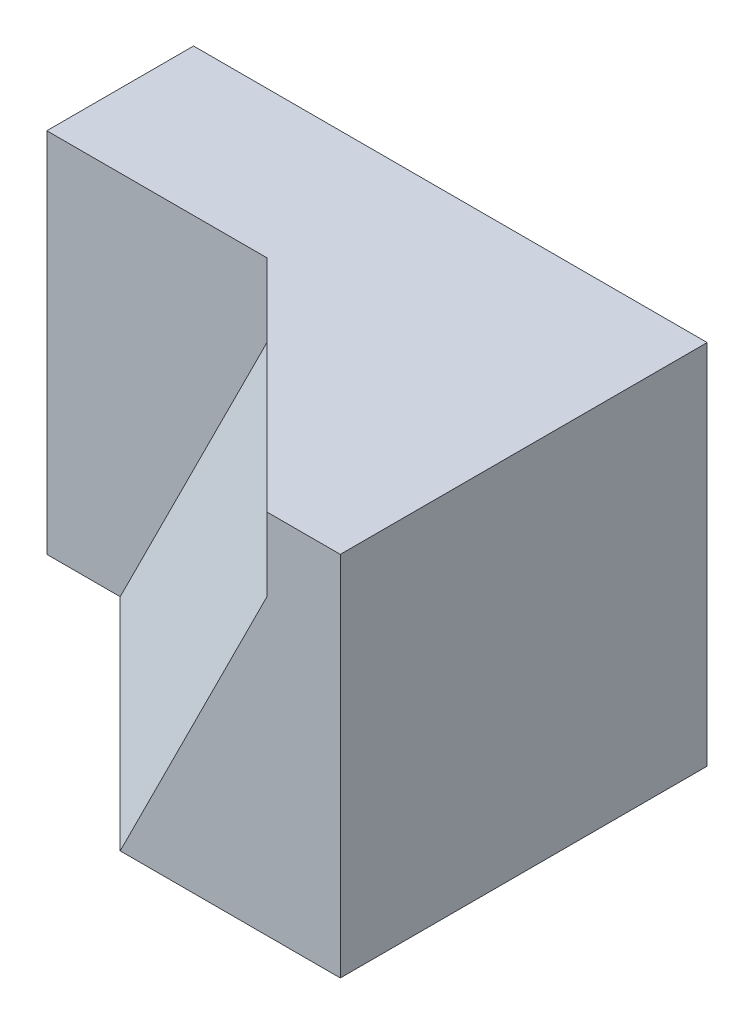
ISO-10303-21;
HEADER;
FILE_DESCRIPTION(('STEP AP214'),'2;1');
FILE_NAME('part.step','',(''),(''),'','','');
FILE_SCHEMA(('AUTOMOTIVE_DESIGN { 1 0 10303 214 1 1 1 1 }'));
ENDSEC;
DATA;
#1=APPLICATION_CONTEXT('core data for automotive mechanical design processes');
#2=APPLICATION_PROTOCOL_DEFINITION('international standard','automotive_design',2000,#1);
#3=PRODUCT_CONTEXT('',#1,'mechanical');
#4=PRODUCT('Part','Part','',(#3));
#5=PRODUCT_RELATED_PRODUCT_CATEGORY('part','',(#4));
#6=PRODUCT_DEFINITION_FORMATION('','',#4);
#7=PRODUCT_DEFINITION_CONTEXT('part definition',#1,'design');
#8=PRODUCT_DEFINITION('design','',#6,#7);
#9=PRODUCT_DEFINITION_SHAPE('','',#8);
#10=(LENGTH_UNIT() NAMED_UNIT(*) SI_UNIT(.MILLI.,.METRE.));
#11=(NAMED_UNIT(*) PLANE_ANGLE_UNIT() SI_UNIT($,.RADIAN.));
#12=(NAMED_UNIT(*) SI_UNIT($,.STERADIAN.) SOLID_ANGLE_UNIT());
#13=UNCERTAINTY_MEASURE_WITH_UNIT(LENGTH_MEASURE(1.E-05),#10,'distance_accuracy_value','');
#14=(GEOMETRIC_REPRESENTATION_CONTEXT(3) GLOBAL_UNCERTAINTY_ASSIGNED_CONTEXT((#13)) GLOBAL_UNIT_ASSIGNED_CONTEXT((#10,
#11,#12)) REPRESENTATION_CONTEXT('',''));
#15=CARTESIAN_POINT('',(0.,0.,0.));
#16=DIRECTION('',(0.,0.,1.));
#17=DIRECTION('',(1.,0.,0.));
#18=AXIS2_PLACEMENT_3D('',#15,#16,#17);
#19=CARTESIAN_POINT('',(0.,0.,50.));
#20=DIRECTION('',(0.,1.,0.));
#21=DIRECTION('',(0.,0.,1.));
#22=AXIS2_PLACEMENT_3D('',#19,#20,#21);
#23=PLANE('',#22);
#24=DIRECTION('',(1.,0.,0.));
#25=VECTOR('',#24,1.);
#26=CARTESIAN_POINT('',(0.,0.,50.));
#27=LINE('',#26,#25);
#28=CARTESIAN_POINT('',(40.,0.,50.));
#29=VERTEX_POINT('',#28);
#30=CARTESIAN_POINT('',(70.,0.,50.));
#31=VERTEX_POINT('',#30);
#32=EDGE_CURVE('E96',#29,#31,#27,.T.);
#33=ORIENTED_EDGE('',*,*,#32,.F.);
#34=DIRECTION('',(-0.707106781186548,0.,-0.707106781186547));
#35=VECTOR('',#34,1.);
#36=CARTESIAN_POINT('',(10.,0.,20.));
#37=LINE('',#36,#35);
#38=CARTESIAN_POINT('',(10.,0.,20.));
#39=VERTEX_POINT('',#38);
#40=EDGE_CURVE('E134',#29,#39,#37,.T.);
#41=ORIENTED_EDGE('',*,*,#40,.T.);
#42=DIRECTION('',(-1.,0.,0.));
#43=VECTOR('',#42,1.);
#44=CARTESIAN_POINT('',(0.,0.,20.));
#45=LINE('',#44,#43);
#46=CARTESIAN_POINT('',(0.,0.,20.));
#47=VERTEX_POINT('',#46);
#48=EDGE_CURVE('E104',#39,#47,#45,.T.);
#49=ORIENTED_EDGE('',*,*,#48,.T.);
#50=DIRECTION('',(0.,0.,-1.));
#51=VECTOR('',#50,1.);
#52=CARTESIAN_POINT('',(0.,0.,50.));
#53=LINE('',#52,#51);
#54=CARTESIAN_POINT('',(0.,0.,0.));
#55=VERTEX_POINT('',#54);
#56=EDGE_CURVE('E11',#47,#55,#53,.T.);
#57=ORIENTED_EDGE('',*,*,#56,.T.);
#58=DIRECTION('',(1.,0.,0.));
#59=VECTOR('',#58,1.);
#60=CARTESIAN_POINT('',(0.,0.,0.));
#61=LINE('',#60,#59);
#62=CARTESIAN_POINT('',(70.,0.,0.));
#63=VERTEX_POINT('',#62);
#64=EDGE_CURVE('E101',#55,#63,#61,.T.);
#65=ORIENTED_EDGE('',*,*,#64,.T.);
#66=DIRECTION('',(0.,0.,-1.));
#67=VECTOR('',#66,1.);
#68=CARTESIAN_POINT('',(70.,0.,50.));
#69=LINE('',#68,#67);
#70=EDGE_CURVE('E41',#31,#63,#69,.T.);
#71=ORIENTED_EDGE('',*,*,#70,.F.);
#72=EDGE_LOOP('',(#33,#41,#49,#57,#65,#71));
#73=FACE_BOUND('',#72,.T.);
#74=ADVANCED_FACE('F33',(#73),#23,.F.);
#75=CARTESIAN_POINT('',(30.,10.,20.));
#76=DIRECTION('',(0.707106781186547,0.,-0.707106781186548));
#77=DIRECTION('',(-0.707106781186548,0.,-0.707106781186547));
#78=AXIS2_PLACEMENT_3D('',#75,#76,#77);
#79=PLANE('',#78);
#80=DIRECTION('',(0.,1.,0.));
#81=VECTOR('',#80,1.);
#82=CARTESIAN_POINT('',(30.,10.,20.));
#83=LINE('',#82,#81);
#84=CARTESIAN_POINT('',(30.,39.9999999999999,20.));
#85=VERTEX_POINT('',#84);
#86=CARTESIAN_POINT('',(30.,50.,20.));
#87=VERTEX_POINT('',#86);
#88=EDGE_CURVE('E153',#85,#87,#83,.T.);
#89=ORIENTED_EDGE('',*,*,#88,.F.);
#90=DIRECTION('',(0.707106781186548,0.,0.707106781186547));
#91=VECTOR('',#90,1.);
#92=CARTESIAN_POINT('',(30.,40.,20.));
#93=LINE('',#92,#91);
#94=CARTESIAN_POINT('',(60.0000000000001,40.,50.));
#95=VERTEX_POINT('',#94);
#96=EDGE_CURVE('E146',#85,#95,#93,.T.);
#97=ORIENTED_EDGE('',*,*,#96,.T.);
#98=DIRECTION('',(0.,1.,0.));
#99=VECTOR('',#98,1.);
#100=CARTESIAN_POINT('',(60.,10.,50.));
#101=LINE('',#100,#99);
#102=CARTESIAN_POINT('',(60.,50.,50.));
#103=VERTEX_POINT('',#102);
#104=EDGE_CURVE('E143',#95,#103,#101,.T.);
#105=ORIENTED_EDGE('',*,*,#104,.T.);
#106=DIRECTION('',(-0.707106781186548,0.,-0.707106781186547));
#107=VECTOR('',#106,1.);
#108=CARTESIAN_POINT('',(30.,50.,20.));
#109=LINE('',#108,#107);
#110=EDGE_CURVE('E145',#103,#87,#109,.T.);
#111=ORIENTED_EDGE('',*,*,#110,.T.);
#112=EDGE_LOOP('',(#89,#97,#105,#111));
#113=FACE_BOUND('',#112,.T.);
#114=ADVANCED_FACE('F160',(#113),#79,.F.);
#115=CARTESIAN_POINT('',(0.,0.,50.));
#116=DIRECTION('',(0.,0.,-1.));
#117=DIRECTION('',(-1.,0.,0.));
#118=AXIS2_PLACEMENT_3D('',#115,#116,#117);
#119=PLANE('',#118);
#120=DIRECTION('',(-0.447213595499958,-0.894427190999916,0.));
#121=VECTOR('',#120,1.);
#122=CARTESIAN_POINT('',(60.0000000000001,40.,50.));
#123=LINE('',#122,#121);
#124=EDGE_CURVE('E138',#95,#29,#123,.T.);
#125=ORIENTED_EDGE('',*,*,#124,.T.);
#126=ORIENTED_EDGE('',*,*,#32,.T.);
#127=DIRECTION('',(0.,1.,0.));
#128=VECTOR('',#127,1.);
#129=CARTESIAN_POINT('',(70.,0.,50.));
#130=LINE('',#129,#128);
#131=CARTESIAN_POINT('',(70.,50.,50.));
#132=VERTEX_POINT('',#131);
#133=EDGE_CURVE('E57',#31,#132,#130,.T.);
#134=ORIENTED_EDGE('',*,*,#133,.T.);
#135=DIRECTION('',(-1.,0.,0.));
#136=VECTOR('',#135,1.);
#137=CARTESIAN_POINT('',(0.,50.,50.));
#138=LINE('',#137,#136);
#139=EDGE_CURVE('E87',#132,#103,#138,.T.);
#140=ORIENTED_EDGE('',*,*,#139,.T.);
#141=ORIENTED_EDGE('',*,*,#104,.F.);
#142=EDGE_LOOP('',(#125,#126,#134,#140,#141));
#143=FACE_BOUND('',#142,.T.);
#144=ADVANCED_FACE('F142',(#143),#119,.F.);
#145=CARTESIAN_POINT('',(0.,0.,50.));
#146=DIRECTION('',(1.,0.,0.));
#147=DIRECTION('',(0.,0.,-1.));
#148=AXIS2_PLACEMENT_3D('',#145,#146,#147);
#149=PLANE('',#148);
#150=ORIENTED_EDGE('',*,*,#56,.F.);
#151=DIRECTION('',(0.,1.,0.));
#152=VECTOR('',#151,1.);
#153=CARTESIAN_POINT('',(0.,0.,20.));
#154=LINE('',#153,#152);
#155=CARTESIAN_POINT('',(0.,50.,20.));
#156=VERTEX_POINT('',#155);
#157=EDGE_CURVE('E83',#47,#156,#154,.T.);
#158=ORIENTED_EDGE('',*,*,#157,.T.);
#159=DIRECTION('',(0.,0.,-1.));
#160=VECTOR('',#159,1.);
#161=CARTESIAN_POINT('',(0.,50.,50.));
#162=LINE('',#161,#160);
#163=CARTESIAN_POINT('',(0.,50.,0.));
#164=VERTEX_POINT('',#163);
#165=EDGE_CURVE('E76',#156,#164,#162,.T.);
#166=ORIENTED_EDGE('',*,*,#165,.T.);
#167=DIRECTION('',(0.,-1.,0.));
#168=VECTOR('',#167,1.);
#169=CARTESIAN_POINT('',(0.,0.,0.));
#170=LINE('',#169,#168);
#171=EDGE_CURVE('E80',#164,#55,#170,.T.);
#172=ORIENTED_EDGE('',*,*,#171,.T.);
#173=EDGE_LOOP('',(#150,#158,#166,#172));
#174=FACE_BOUND('',#173,.T.);
#175=ADVANCED_FACE('F35',(#174),#149,.F.);
#176=CARTESIAN_POINT('',(70.,0.,50.));
#177=DIRECTION('',(-1.,0.,0.));
#178=DIRECTION('',(0.,0.,1.));
#179=AXIS2_PLACEMENT_3D('',#176,#177,#178);
#180=PLANE('',#179);
#181=DIRECTION('',(0.,1.,0.));
#182=VECTOR('',#181,1.);
#183=CARTESIAN_POINT('',(70.,0.,0.));
#184=LINE('',#183,#182);
#185=CARTESIAN_POINT('',(70.,50.,0.));
#186=VERTEX_POINT('',#185);
#187=EDGE_CURVE('E97',#63,#186,#184,.T.);
#188=ORIENTED_EDGE('',*,*,#187,.T.);
#189=DIRECTION('',(0.,0.,-1.));
#190=VECTOR('',#189,1.);
#191=CARTESIAN_POINT('',(70.,50.,50.));
#192=LINE('',#191,#190);
#193=EDGE_CURVE('E86',#132,#186,#192,.T.);
#194=ORIENTED_EDGE('',*,*,#193,.F.);
#195=ORIENTED_EDGE('',*,*,#133,.F.);
#196=ORIENTED_EDGE('',*,*,#70,.T.);
#197=EDGE_LOOP('',(#188,#194,#195,#196));
#198=FACE_BOUND('',#197,.T.);
#199=ADVANCED_FACE('F113',(#198),#180,.F.);
#200=CARTESIAN_POINT('',(0.,50.,50.));
#201=DIRECTION('',(0.,-1.,0.));
#202=DIRECTION('',(0.,0.,-1.));
#203=AXIS2_PLACEMENT_3D('',#200,#201,#202);
#204=PLANE('',#203);
#205=DIRECTION('',(-1.,0.,0.));
#206=VECTOR('',#205,1.);
#207=CARTESIAN_POINT('',(0.,50.,20.));
#208=LINE('',#207,#206);
#209=EDGE_CURVE('E140',#87,#156,#208,.T.);
#210=ORIENTED_EDGE('',*,*,#209,.F.);
#211=ORIENTED_EDGE('',*,*,#110,.F.);
#212=ORIENTED_EDGE('',*,*,#139,.F.);
#213=ORIENTED_EDGE('',*,*,#193,.T.);
#214=DIRECTION('',(-1.,0.,0.));
#215=VECTOR('',#214,1.);
#216=CARTESIAN_POINT('',(0.,50.,0.));
#217=LINE('',#216,#215);
#218=EDGE_CURVE('E91',#186,#164,#217,.T.);
#219=ORIENTED_EDGE('',*,*,#218,.T.);
#220=ORIENTED_EDGE('',*,*,#165,.F.);
#221=EDGE_LOOP('',(#210,#211,#212,#213,#219,#220));
#222=FACE_BOUND('',#221,.T.);
#223=ADVANCED_FACE('F92',(#222),#204,.F.);
#224=CARTESIAN_POINT('',(0.,0.,0.));
#225=DIRECTION('',(0.,0.,-1.));
#226=DIRECTION('',(-1.,0.,0.));
#227=AXIS2_PLACEMENT_3D('',#224,#225,#226);
#228=PLANE('',#227);
#229=ORIENTED_EDGE('',*,*,#171,.F.);
#230=ORIENTED_EDGE('',*,*,#218,.F.);
#231=ORIENTED_EDGE('',*,*,#187,.F.);
#232=ORIENTED_EDGE('',*,*,#64,.F.);
#233=EDGE_LOOP('',(#229,#230,#231,#232));
#234=FACE_BOUND('',#233,.T.);
#235=ADVANCED_FACE('F100',(#234),#228,.T.);
#236=CARTESIAN_POINT('',(0.,0.,20.));
#237=DIRECTION('',(0.,0.,-1.));
#238=DIRECTION('',(-1.,0.,0.));
#239=AXIS2_PLACEMENT_3D('',#236,#237,#238);
#240=PLANE('',#239);
#241=ORIENTED_EDGE('',*,*,#48,.F.);
#242=DIRECTION('',(0.447213595499958,0.894427190999916,0.));
#243=VECTOR('',#242,1.);
#244=CARTESIAN_POINT('',(10.,0.,20.));
#245=LINE('',#244,#243);
#246=EDGE_CURVE('E48',#39,#85,#245,.T.);
#247=ORIENTED_EDGE('',*,*,#246,.T.);
#248=ORIENTED_EDGE('',*,*,#88,.T.);
#249=ORIENTED_EDGE('',*,*,#209,.T.);
#250=ORIENTED_EDGE('',*,*,#157,.F.);
#251=EDGE_LOOP('',(#241,#247,#248,#249,#250));
#252=FACE_BOUND('',#251,.T.);
#253=ADVANCED_FACE('F161',(#252),#240,.F.);
#254=CARTESIAN_POINT('',(-4.44444444444444,2.22222222222222,4.44444444444444));
#255=DIRECTION('',(-0.666666666666666,0.333333333333333,0.666666666666667));
#256=DIRECTION('',(0.707106781186548,0.,0.707106781186547));
#257=AXIS2_PLACEMENT_3D('',#254,#255,#256);
#258=PLANE('',#257);
#259=ORIENTED_EDGE('',*,*,#246,.F.);
#260=ORIENTED_EDGE('',*,*,#40,.F.);
#261=ORIENTED_EDGE('',*,*,#124,.F.);
#262=ORIENTED_EDGE('',*,*,#96,.F.);
#263=EDGE_LOOP('',(#259,#260,#261,#262));
#264=FACE_BOUND('',#263,.T.);
#265=ADVANCED_FACE('F136',(#264),#258,.T.);
#266=CLOSED_SHELL('',(#74,#114,#144,#175,#199,#223,#235,#253,#265));
#267=MANIFOLD_SOLID_BREP('B2',#266);
#268=ADVANCED_BREP_SHAPE_REPRESENTATION('',(#18,#267),#14);
#269=SHAPE_DEFINITION_REPRESENTATION(#9,#268);
ENDSEC;
END-ISO-10303-21;
